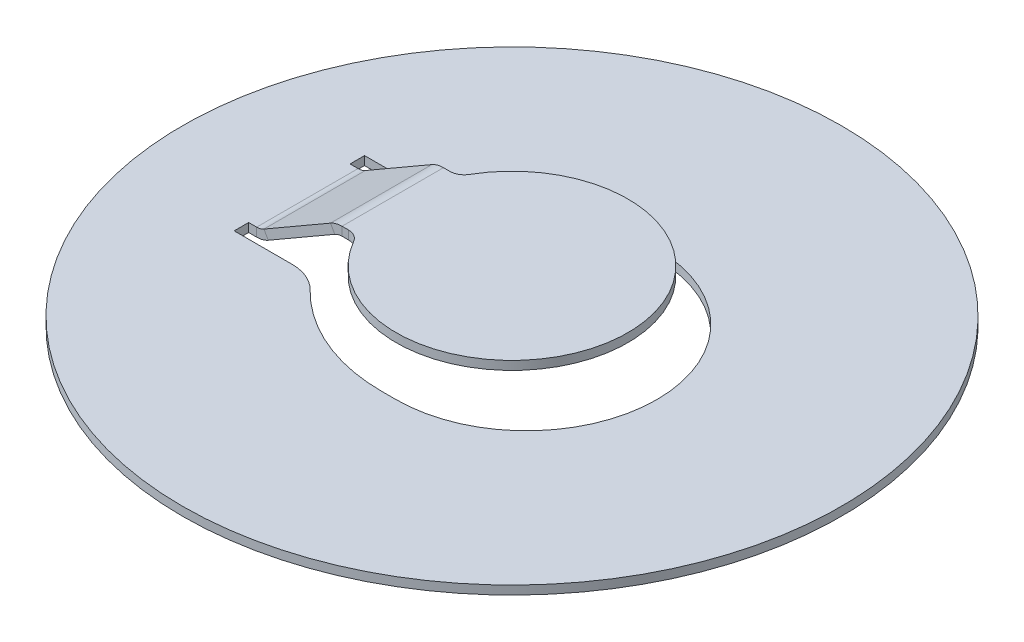
ISO-10303-21;
HEADER;
FILE_DESCRIPTION(('STEP AP214'),'2;1');
FILE_NAME('part.step','',(''),(''),'','','');
FILE_SCHEMA(('AUTOMOTIVE_DESIGN { 1 0 10303 214 1 1 1 1 }'));
ENDSEC;
DATA;
#1=APPLICATION_CONTEXT('core data for automotive mechanical design processes');
#2=APPLICATION_PROTOCOL_DEFINITION('international standard','automotive_design',2000,#1);
#3=PRODUCT_CONTEXT('',#1,'mechanical');
#4=PRODUCT('Part','Part','',(#3));
#5=PRODUCT_RELATED_PRODUCT_CATEGORY('part','',(#4));
#6=PRODUCT_DEFINITION_FORMATION('','',#4);
#7=PRODUCT_DEFINITION_CONTEXT('part definition',#1,'design');
#8=PRODUCT_DEFINITION('design','',#6,#7);
#9=PRODUCT_DEFINITION_SHAPE('','',#8);
#10=(LENGTH_UNIT() NAMED_UNIT(*) SI_UNIT(.MILLI.,.METRE.));
#11=(NAMED_UNIT(*) PLANE_ANGLE_UNIT() SI_UNIT($,.RADIAN.));
#12=(NAMED_UNIT(*) SI_UNIT($,.STERADIAN.) SOLID_ANGLE_UNIT());
#13=UNCERTAINTY_MEASURE_WITH_UNIT(LENGTH_MEASURE(1.E-05),#10,'distance_accuracy_value','');
#14=(GEOMETRIC_REPRESENTATION_CONTEXT(3) GLOBAL_UNCERTAINTY_ASSIGNED_CONTEXT((#13)) GLOBAL_UNIT_ASSIGNED_CONTEXT((#10,
#11,#12)) REPRESENTATION_CONTEXT('',''));
#15=CARTESIAN_POINT('',(0.,0.,0.));
#16=DIRECTION('',(0.,0.,1.));
#17=DIRECTION('',(1.,0.,0.));
#18=AXIS2_PLACEMENT_3D('',#15,#16,#17);
#19=CARTESIAN_POINT('',(-6.92846096908269,0.299999999999998,-1.75));
#20=DIRECTION('',(0.,0.,-1.));
#21=DIRECTION('',(-0.866025403784442,-0.499999999999995,0.));
#22=AXIS2_PLACEMENT_3D('',#19,#20,#21);
#23=PLANE('',#22);
#24=DIRECTION('',(-0.499999999999995,0.866025403784441,0.));
#25=VECTOR('',#24,1.);
#26=CARTESIAN_POINT('',(-4.51602540378444,1.69282032302755,-1.75));
#27=LINE('',#26,#25);
#28=CARTESIAN_POINT('',(-4.36602540378444,1.43301270189222,-1.75));
#29=VERTEX_POINT('',#28);
#30=CARTESIAN_POINT('',(-4.51602540378444,1.69282032302755,-1.75));
#31=VERTEX_POINT('',#30);
#32=EDGE_CURVE('E11',#29,#31,#27,.T.);
#33=ORIENTED_EDGE('',*,*,#32,.F.);
#34=DIRECTION('',(-0.866025403784442,-0.499999999999995,0.));
#35=VECTOR('',#34,1.);
#36=CARTESIAN_POINT('',(-6.77846096908269,0.0401923788646675,-1.75));
#37=LINE('',#36,#35);
#38=CARTESIAN_POINT('',(-6.66243556529825,0.107179676972447,-1.75));
#39=VERTEX_POINT('',#38);
#40=EDGE_CURVE('E137',#29,#39,#37,.T.);
#41=ORIENTED_EDGE('',*,*,#40,.T.);
#42=DIRECTION('',(-0.499999999999995,0.866025403784441,0.));
#43=VECTOR('',#42,1.);
#44=CARTESIAN_POINT('',(-6.81243556529825,0.366987298107779,-1.75));
#45=LINE('',#44,#43);
#46=CARTESIAN_POINT('',(-6.81243556529825,0.366987298107779,-1.75));
#47=VERTEX_POINT('',#46);
#48=EDGE_CURVE('E49',#39,#47,#45,.T.);
#49=ORIENTED_EDGE('',*,*,#48,.T.);
#50=DIRECTION('',(-0.866025403784442,-0.499999999999995,0.));
#51=VECTOR('',#50,1.);
#52=CARTESIAN_POINT('',(-6.92846096908269,0.299999999999998,-1.75));
#53=LINE('',#52,#51);
#54=EDGE_CURVE('E140',#31,#47,#53,.T.);
#55=ORIENTED_EDGE('',*,*,#54,.F.);
#56=EDGE_LOOP('',(#33,#41,#49,#55));
#57=FACE_BOUND('',#56,.T.);
#58=ADVANCED_FACE('F39',(#57),#23,.T.);
#59=CARTESIAN_POINT('',(-7.06243556529825,0.8,-1.75));
#60=DIRECTION('',(0.,0.,-1.));
#61=DIRECTION('',(-1.,0.,0.));
#62=AXIS2_PLACEMENT_3D('',#59,#60,#61);
#63=PLANE('',#62);
#64=ORIENTED_EDGE('',*,*,#48,.F.);
#65=CARTESIAN_POINT('',(-7.06243556529825,0.8,-1.75));
#66=DIRECTION('',(0.,0.,-1.));
#67=DIRECTION('',(-1.,0.,0.));
#68=AXIS2_PLACEMENT_3D('',#65,#66,#67);
#69=CIRCLE('',#68,0.8);
#70=CARTESIAN_POINT('',(-7.06243556529825,0.,-1.75));
#71=VERTEX_POINT('',#70);
#72=EDGE_CURVE('E176',#39,#71,#69,.T.);
#73=ORIENTED_EDGE('',*,*,#72,.T.);
#74=DIRECTION('',(0.,1.,0.));
#75=VECTOR('',#74,1.);
#76=CARTESIAN_POINT('',(-7.06243556529825,0.3,-1.75));
#77=LINE('',#76,#75);
#78=CARTESIAN_POINT('',(-7.06243556529825,0.3,-1.75));
#79=VERTEX_POINT('',#78);
#80=EDGE_CURVE('E57',#71,#79,#77,.T.);
#81=ORIENTED_EDGE('',*,*,#80,.T.);
#82=CARTESIAN_POINT('',(-7.06243556529825,0.8,-1.75));
#83=DIRECTION('',(0.,0.,1.));
#84=DIRECTION('',(1.,0.,0.));
#85=AXIS2_PLACEMENT_3D('',#82,#83,#84);
#86=CIRCLE('',#85,0.5);
#87=EDGE_CURVE('E257',#47,#79,#86,.F.);
#88=ORIENTED_EDGE('',*,*,#87,.F.);
#89=EDGE_LOOP('',(#64,#73,#81,#88));
#90=FACE_BOUND('',#89,.T.);
#91=ADVANCED_FACE('F258',(#90),#63,.T.);
#92=CARTESIAN_POINT('',(-6.92846096908269,0.3,-1.75));
#93=DIRECTION('',(0.,0.,-1.));
#94=DIRECTION('',(-1.,0.,0.));
#95=AXIS2_PLACEMENT_3D('',#92,#93,#94);
#96=PLANE('',#95);
#97=ORIENTED_EDGE('',*,*,#80,.F.);
#98=DIRECTION('',(-1.,0.,0.));
#99=VECTOR('',#98,1.);
#100=CARTESIAN_POINT('',(-6.92846096908269,0.,-1.75));
#101=LINE('',#100,#99);
#102=CARTESIAN_POINT('',(-7.33957850633199,0.,-1.75));
#103=VERTEX_POINT('',#102);
#104=EDGE_CURVE('E304',#71,#103,#101,.T.);
#105=ORIENTED_EDGE('',*,*,#104,.T.);
#106=DIRECTION('',(0.,1.,0.));
#107=VECTOR('',#106,1.);
#108=CARTESIAN_POINT('',(-7.33957850633199,0.3,-1.75));
#109=LINE('',#108,#107);
#110=CARTESIAN_POINT('',(-7.33957850633199,0.3,-1.75));
#111=VERTEX_POINT('',#110);
#112=EDGE_CURVE('E241',#103,#111,#109,.T.);
#113=ORIENTED_EDGE('',*,*,#112,.T.);
#114=DIRECTION('',(-1.,0.,0.));
#115=VECTOR('',#114,1.);
#116=CARTESIAN_POINT('',(-6.92846096908269,0.3,-1.75));
#117=LINE('',#116,#115);
#118=EDGE_CURVE('E352',#79,#111,#117,.T.);
#119=ORIENTED_EDGE('',*,*,#118,.F.);
#120=EDGE_LOOP('',(#97,#105,#113,#119));
#121=FACE_BOUND('',#120,.T.);
#122=ADVANCED_FACE('F349',(#121),#96,.T.);
#123=CARTESIAN_POINT('',(-7.33957850633199,0.3,-1.75));
#124=DIRECTION('',(1.,0.,0.));
#125=DIRECTION('',(0.,0.,-1.));
#126=AXIS2_PLACEMENT_3D('',#123,#124,#125);
#127=PLANE('',#126);
#128=ORIENTED_EDGE('',*,*,#112,.F.);
#129=DIRECTION('',(0.,0.,1.));
#130=VECTOR('',#129,1.);
#131=CARTESIAN_POINT('',(-7.33957850633199,0.,-15.));
#132=LINE('',#131,#130);
#133=CARTESIAN_POINT('',(-7.33957850633199,0.,-2.25));
#134=VERTEX_POINT('',#133);
#135=EDGE_CURVE('E333',#103,#134,#132,.F.);
#136=ORIENTED_EDGE('',*,*,#135,.T.);
#137=DIRECTION('',(0.,1.,0.));
#138=VECTOR('',#137,1.);
#139=CARTESIAN_POINT('',(-7.33957850633199,0.3,-2.25));
#140=LINE('',#139,#138);
#141=CARTESIAN_POINT('',(-7.33957850633199,0.3,-2.25));
#142=VERTEX_POINT('',#141);
#143=EDGE_CURVE('E238',#134,#142,#140,.T.);
#144=ORIENTED_EDGE('',*,*,#143,.T.);
#145=DIRECTION('',(0.,0.,-1.));
#146=VECTOR('',#145,1.);
#147=CARTESIAN_POINT('',(-7.33957850633199,0.3,-1.75));
#148=LINE('',#147,#146);
#149=EDGE_CURVE('E356',#111,#142,#148,.T.);
#150=ORIENTED_EDGE('',*,*,#149,.F.);
#151=EDGE_LOOP('',(#128,#136,#144,#150));
#152=FACE_BOUND('',#151,.T.);
#153=ADVANCED_FACE('F516',(#152),#127,.T.);
#154=CARTESIAN_POINT('',(-7.33957850633199,0.3,-2.25));
#155=DIRECTION('',(0.,0.,1.));
#156=DIRECTION('',(1.,0.,0.));
#157=AXIS2_PLACEMENT_3D('',#154,#155,#156);
#158=PLANE('',#157);
#159=ORIENTED_EDGE('',*,*,#143,.F.);
#160=DIRECTION('',(-1.,0.,0.));
#161=VECTOR('',#160,1.);
#162=CARTESIAN_POINT('',(-6.92846096908269,0.,-2.25));
#163=LINE('',#162,#161);
#164=CARTESIAN_POINT('',(-5.33957850633199,0.,-2.25));
#165=VERTEX_POINT('',#164);
#166=EDGE_CURVE('E330',#134,#165,#163,.F.);
#167=ORIENTED_EDGE('',*,*,#166,.T.);
#168=DIRECTION('',(0.,1.,0.));
#169=VECTOR('',#168,1.);
#170=CARTESIAN_POINT('',(-5.33957850633199,0.3,-2.25));
#171=LINE('',#170,#169);
#172=CARTESIAN_POINT('',(-5.33957850633199,0.3,-2.25));
#173=VERTEX_POINT('',#172);
#174=EDGE_CURVE('E235',#165,#173,#171,.T.);
#175=ORIENTED_EDGE('',*,*,#174,.T.);
#176=DIRECTION('',(1.,0.,0.));
#177=VECTOR('',#176,1.);
#178=CARTESIAN_POINT('',(-7.33957850633199,0.3,-2.25));
#179=LINE('',#178,#177);
#180=EDGE_CURVE('E379',#142,#173,#179,.T.);
#181=ORIENTED_EDGE('',*,*,#180,.F.);
#182=EDGE_LOOP('',(#159,#167,#175,#181));
#183=FACE_BOUND('',#182,.T.);
#184=ADVANCED_FACE('F514',(#183),#158,.T.);
#185=CARTESIAN_POINT('',(-5.33957850633199,0.3,-3.75));
#186=DIRECTION('',(0.,1.,0.));
#187=DIRECTION('',(-1.,0.,0.));
#188=AXIS2_PLACEMENT_3D('',#185,#186,#187);
#189=CYLINDRICAL_SURFACE('',#188,1.5);
#190=ORIENTED_EDGE('',*,*,#174,.F.);
#191=CARTESIAN_POINT('',(-5.33957850633199,0.,-3.75));
#192=DIRECTION('',(0.,1.,0.));
#193=DIRECTION('',(0.,0.,1.));
#194=AXIS2_PLACEMENT_3D('',#191,#192,#193);
#195=CIRCLE('',#194,1.5);
#196=CARTESIAN_POINT('',(-4.26605179506073,0.,-2.70236437623231));
#197=VERTEX_POINT('',#196);
#198=EDGE_CURVE('E327',#165,#197,#195,.T.);
#199=ORIENTED_EDGE('',*,*,#198,.T.);
#200=DIRECTION('',(0.,1.,0.));
#201=VECTOR('',#200,1.);
#202=CARTESIAN_POINT('',(-4.26605179506073,0.3,-2.70236437623231));
#203=LINE('',#202,#201);
#204=CARTESIAN_POINT('',(-4.26605179506073,0.3,-2.70236437623231));
#205=VERTEX_POINT('',#204);
#206=EDGE_CURVE('E232',#197,#205,#203,.T.);
#207=ORIENTED_EDGE('',*,*,#206,.T.);
#208=CARTESIAN_POINT('',(-5.33957850633199,0.3,-3.75));
#209=DIRECTION('',(0.,1.,0.));
#210=DIRECTION('',(0.,0.,1.));
#211=AXIS2_PLACEMENT_3D('',#208,#209,#210);
#212=CIRCLE('',#211,1.5);
#213=EDGE_CURVE('E382',#173,#205,#212,.T.);
#214=ORIENTED_EDGE('',*,*,#213,.F.);
#215=EDGE_LOOP('',(#190,#199,#207,#214));
#216=FACE_BOUND('',#215,.T.);
#217=ADVANCED_FACE('F511',(#216),#189,.T.);
#218=CARTESIAN_POINT('',(0.,0.3,1.46079969450723));
#219=DIRECTION('',(0.,1.,0.));
#220=DIRECTION('',(-1.,0.,0.));
#221=AXIS2_PLACEMENT_3D('',#218,#219,#220);
#222=CYLINDRICAL_SURFACE('',#221,5.96079969450723);
#223=ORIENTED_EDGE('',*,*,#206,.F.);
#224=CARTESIAN_POINT('',(0.,0.,1.46079969450723));
#225=DIRECTION('',(0.,-1.,0.));
#226=DIRECTION('',(0.,0.,-1.));
#227=AXIS2_PLACEMENT_3D('',#224,#225,#226);
#228=CIRCLE('',#227,5.96079969450723);
#229=CARTESIAN_POINT('',(0.,0.,-4.5));
#230=VERTEX_POINT('',#229);
#231=EDGE_CURVE('E324',#197,#230,#228,.T.);
#232=ORIENTED_EDGE('',*,*,#231,.T.);
#233=DIRECTION('',(0.,1.,0.));
#234=VECTOR('',#233,1.);
#235=CARTESIAN_POINT('',(0.,0.3,-4.5));
#236=LINE('',#235,#234);
#237=CARTESIAN_POINT('',(0.,0.3,-4.5));
#238=VERTEX_POINT('',#237);
#239=EDGE_CURVE('E229',#230,#238,#236,.T.);
#240=ORIENTED_EDGE('',*,*,#239,.T.);
#241=CARTESIAN_POINT('',(0.,0.3,1.46079969450723));
#242=DIRECTION('',(0.,-1.,0.));
#243=DIRECTION('',(0.,0.,-1.));
#244=AXIS2_PLACEMENT_3D('',#241,#242,#243);
#245=CIRCLE('',#244,5.96079969450723);
#246=EDGE_CURVE('E385',#205,#238,#245,.T.);
#247=ORIENTED_EDGE('',*,*,#246,.F.);
#248=EDGE_LOOP('',(#223,#232,#240,#247));
#249=FACE_BOUND('',#248,.T.);
#250=ADVANCED_FACE('F508',(#249),#222,.F.);
#251=CARTESIAN_POINT('',(0.,0.3,-4.5));
#252=DIRECTION('',(0.,0.,1.));
#253=DIRECTION('',(1.,0.,0.));
#254=AXIS2_PLACEMENT_3D('',#251,#252,#253);
#255=PLANE('',#254);
#256=ORIENTED_EDGE('',*,*,#239,.F.);
#257=DIRECTION('',(-1.,0.,0.));
#258=VECTOR('',#257,1.);
#259=CARTESIAN_POINT('',(-6.92846096908269,0.,-4.5));
#260=LINE('',#259,#258);
#261=CARTESIAN_POINT('',(0.499999999999998,0.,-4.5));
#262=VERTEX_POINT('',#261);
#263=EDGE_CURVE('E321',#230,#262,#260,.F.);
#264=ORIENTED_EDGE('',*,*,#263,.T.);
#265=DIRECTION('',(0.,1.,0.));
#266=VECTOR('',#265,1.);
#267=CARTESIAN_POINT('',(0.499999999999998,0.3,-4.5));
#268=LINE('',#267,#266);
#269=CARTESIAN_POINT('',(0.499999999999998,0.3,-4.5));
#270=VERTEX_POINT('',#269);
#271=EDGE_CURVE('E226',#262,#270,#268,.T.);
#272=ORIENTED_EDGE('',*,*,#271,.T.);
#273=DIRECTION('',(1.,0.,0.));
#274=VECTOR('',#273,1.);
#275=CARTESIAN_POINT('',(0.,0.3,-4.5));
#276=LINE('',#275,#274);
#277=EDGE_CURVE('E388',#238,#270,#276,.T.);
#278=ORIENTED_EDGE('',*,*,#277,.F.);
#279=EDGE_LOOP('',(#256,#264,#272,#278));
#280=FACE_BOUND('',#279,.T.);
#281=ADVANCED_FACE('F503',(#280),#255,.T.);
#282=CARTESIAN_POINT('',(0.499999999999998,0.3,0.));
#283=DIRECTION('',(0.,1.,0.));
#284=DIRECTION('',(-1.,0.,0.));
#285=AXIS2_PLACEMENT_3D('',#282,#283,#284);
#286=CYLINDRICAL_SURFACE('',#285,4.5);
#287=ORIENTED_EDGE('',*,*,#271,.F.);
#288=CARTESIAN_POINT('',(0.499999999999998,0.,0.));
#289=DIRECTION('',(0.,-1.,0.));
#290=DIRECTION('',(0.,0.,-1.));
#291=AXIS2_PLACEMENT_3D('',#288,#289,#290);
#292=CIRCLE('',#291,4.5);
#293=CARTESIAN_POINT('',(0.499999999999998,0.,4.5));
#294=VERTEX_POINT('',#293);
#295=EDGE_CURVE('E318',#262,#294,#292,.T.);
#296=ORIENTED_EDGE('',*,*,#295,.T.);
#297=DIRECTION('',(0.,1.,0.));
#298=VECTOR('',#297,1.);
#299=CARTESIAN_POINT('',(0.499999999999998,0.3,4.5));
#300=LINE('',#299,#298);
#301=CARTESIAN_POINT('',(0.499999999999998,0.3,4.5));
#302=VERTEX_POINT('',#301);
#303=EDGE_CURVE('E223',#294,#302,#300,.T.);
#304=ORIENTED_EDGE('',*,*,#303,.T.);
#305=CARTESIAN_POINT('',(0.499999999999998,0.3,0.));
#306=DIRECTION('',(0.,-1.,0.));
#307=DIRECTION('',(0.,0.,1.));
#308=AXIS2_PLACEMENT_3D('',#305,#306,#307);
#309=CIRCLE('',#308,4.5);
#310=EDGE_CURVE('E391',#270,#302,#309,.T.);
#311=ORIENTED_EDGE('',*,*,#310,.F.);
#312=EDGE_LOOP('',(#287,#296,#304,#311));
#313=FACE_BOUND('',#312,.T.);
#314=ADVANCED_FACE('F499',(#313),#286,.F.);
#315=CARTESIAN_POINT('',(0.,0.3,4.5));
#316=DIRECTION('',(0.,0.,-1.));
#317=DIRECTION('',(-1.,0.,0.));
#318=AXIS2_PLACEMENT_3D('',#315,#316,#317);
#319=PLANE('',#318);
#320=ORIENTED_EDGE('',*,*,#303,.F.);
#321=DIRECTION('',(-1.,0.,0.));
#322=VECTOR('',#321,1.);
#323=CARTESIAN_POINT('',(-6.92846096908269,0.,4.5));
#324=LINE('',#323,#322);
#325=CARTESIAN_POINT('',(0.,0.,4.5));
#326=VERTEX_POINT('',#325);
#327=EDGE_CURVE('E315',#294,#326,#324,.T.);
#328=ORIENTED_EDGE('',*,*,#327,.T.);
#329=DIRECTION('',(0.,1.,0.));
#330=VECTOR('',#329,1.);
#331=CARTESIAN_POINT('',(0.,0.3,4.5));
#332=LINE('',#331,#330);
#333=CARTESIAN_POINT('',(0.,0.3,4.5));
#334=VERTEX_POINT('',#333);
#335=EDGE_CURVE('E220',#326,#334,#332,.T.);
#336=ORIENTED_EDGE('',*,*,#335,.T.);
#337=DIRECTION('',(-1.,0.,0.));
#338=VECTOR('',#337,1.);
#339=CARTESIAN_POINT('',(0.,0.3,4.5));
#340=LINE('',#339,#338);
#341=EDGE_CURVE('E394',#302,#334,#340,.T.);
#342=ORIENTED_EDGE('',*,*,#341,.F.);
#343=EDGE_LOOP('',(#320,#328,#336,#342));
#344=FACE_BOUND('',#343,.T.);
#345=ADVANCED_FACE('F496',(#344),#319,.T.);
#346=CARTESIAN_POINT('',(0.,0.3,-1.46079969450723));
#347=DIRECTION('',(0.,1.,0.));
#348=DIRECTION('',(-1.,0.,0.));
#349=AXIS2_PLACEMENT_3D('',#346,#347,#348);
#350=CYLINDRICAL_SURFACE('',#349,5.96079969450723);
#351=ORIENTED_EDGE('',*,*,#335,.F.);
#352=CARTESIAN_POINT('',(0.,0.,-1.46079969450723));
#353=DIRECTION('',(0.,-1.,0.));
#354=DIRECTION('',(0.,0.,-1.));
#355=AXIS2_PLACEMENT_3D('',#352,#353,#354);
#356=CIRCLE('',#355,5.96079969450723);
#357=CARTESIAN_POINT('',(-4.26605179506073,0.,2.70236437623231));
#358=VERTEX_POINT('',#357);
#359=EDGE_CURVE('E312',#326,#358,#356,.T.);
#360=ORIENTED_EDGE('',*,*,#359,.T.);
#361=DIRECTION('',(0.,1.,0.));
#362=VECTOR('',#361,1.);
#363=CARTESIAN_POINT('',(-4.26605179506073,0.3,2.70236437623231));
#364=LINE('',#363,#362);
#365=CARTESIAN_POINT('',(-4.26605179506073,0.3,2.70236437623231));
#366=VERTEX_POINT('',#365);
#367=EDGE_CURVE('E217',#358,#366,#364,.T.);
#368=ORIENTED_EDGE('',*,*,#367,.T.);
#369=CARTESIAN_POINT('',(0.,0.3,-1.46079969450723));
#370=DIRECTION('',(0.,-1.,0.));
#371=DIRECTION('',(0.,0.,1.));
#372=AXIS2_PLACEMENT_3D('',#369,#370,#371);
#373=CIRCLE('',#372,5.96079969450723);
#374=EDGE_CURVE('E397',#334,#366,#373,.T.);
#375=ORIENTED_EDGE('',*,*,#374,.F.);
#376=EDGE_LOOP('',(#351,#360,#368,#375));
#377=FACE_BOUND('',#376,.T.);
#378=ADVANCED_FACE('F491',(#377),#350,.F.);
#379=CARTESIAN_POINT('',(-5.33957850633199,0.3,3.75));
#380=DIRECTION('',(0.,1.,0.));
#381=DIRECTION('',(-1.,0.,0.));
#382=AXIS2_PLACEMENT_3D('',#379,#380,#381);
#383=CYLINDRICAL_SURFACE('',#382,1.5);
#384=ORIENTED_EDGE('',*,*,#367,.F.);
#385=CARTESIAN_POINT('',(-5.33957850633199,0.,3.75));
#386=DIRECTION('',(0.,1.,0.));
#387=DIRECTION('',(0.,0.,1.));
#388=AXIS2_PLACEMENT_3D('',#385,#386,#387);
#389=CIRCLE('',#388,1.5);
#390=CARTESIAN_POINT('',(-5.33957850633199,0.,2.25));
#391=VERTEX_POINT('',#390);
#392=EDGE_CURVE('E309',#358,#391,#389,.T.);
#393=ORIENTED_EDGE('',*,*,#392,.T.);
#394=DIRECTION('',(0.,1.,0.));
#395=VECTOR('',#394,1.);
#396=CARTESIAN_POINT('',(-5.33957850633199,0.3,2.25));
#397=LINE('',#396,#395);
#398=CARTESIAN_POINT('',(-5.33957850633199,0.3,2.25));
#399=VERTEX_POINT('',#398);
#400=EDGE_CURVE('E214',#391,#399,#397,.T.);
#401=ORIENTED_EDGE('',*,*,#400,.T.);
#402=CARTESIAN_POINT('',(-5.33957850633199,0.3,3.75));
#403=DIRECTION('',(0.,1.,0.));
#404=DIRECTION('',(0.,0.,-1.));
#405=AXIS2_PLACEMENT_3D('',#402,#403,#404);
#406=CIRCLE('',#405,1.5);
#407=EDGE_CURVE('E400',#366,#399,#406,.T.);
#408=ORIENTED_EDGE('',*,*,#407,.F.);
#409=EDGE_LOOP('',(#384,#393,#401,#408));
#410=FACE_BOUND('',#409,.T.);
#411=ADVANCED_FACE('F487',(#410),#383,.T.);
#412=CARTESIAN_POINT('',(-7.33957850633199,0.3,2.25));
#413=DIRECTION('',(0.,0.,-1.));
#414=DIRECTION('',(-1.,0.,0.));
#415=AXIS2_PLACEMENT_3D('',#412,#413,#414);
#416=PLANE('',#415);
#417=ORIENTED_EDGE('',*,*,#400,.F.);
#418=DIRECTION('',(-1.,0.,0.));
#419=VECTOR('',#418,1.);
#420=CARTESIAN_POINT('',(-6.92846096908269,0.,2.25));
#421=LINE('',#420,#419);
#422=CARTESIAN_POINT('',(-7.33957850633199,0.,2.25));
#423=VERTEX_POINT('',#422);
#424=EDGE_CURVE('E184',#391,#423,#421,.T.);
#425=ORIENTED_EDGE('',*,*,#424,.T.);
#426=DIRECTION('',(0.,1.,0.));
#427=VECTOR('',#426,1.);
#428=CARTESIAN_POINT('',(-7.33957850633199,0.3,2.25));
#429=LINE('',#428,#427);
#430=CARTESIAN_POINT('',(-7.33957850633199,0.3,2.25));
#431=VERTEX_POINT('',#430);
#432=EDGE_CURVE('E211',#423,#431,#429,.T.);
#433=ORIENTED_EDGE('',*,*,#432,.T.);
#434=DIRECTION('',(-1.,0.,0.));
#435=VECTOR('',#434,1.);
#436=CARTESIAN_POINT('',(-7.33957850633199,0.3,2.25));
#437=LINE('',#436,#435);
#438=EDGE_CURVE('E403',#399,#431,#437,.T.);
#439=ORIENTED_EDGE('',*,*,#438,.F.);
#440=EDGE_LOOP('',(#417,#425,#433,#439));
#441=FACE_BOUND('',#440,.T.);
#442=ADVANCED_FACE('F483',(#441),#416,.T.);
#443=CARTESIAN_POINT('',(-7.33957850633199,0.3,1.75));
#444=DIRECTION('',(1.,0.,0.));
#445=DIRECTION('',(0.,0.,-1.));
#446=AXIS2_PLACEMENT_3D('',#443,#444,#445);
#447=PLANE('',#446);
#448=ORIENTED_EDGE('',*,*,#432,.F.);
#449=DIRECTION('',(0.,0.,1.));
#450=VECTOR('',#449,1.);
#451=CARTESIAN_POINT('',(-7.33957850633199,0.,-15.));
#452=LINE('',#451,#450);
#453=CARTESIAN_POINT('',(-7.33957850633199,0.,1.75));
#454=VERTEX_POINT('',#453);
#455=EDGE_CURVE('E167',#423,#454,#452,.F.);
#456=ORIENTED_EDGE('',*,*,#455,.T.);
#457=DIRECTION('',(0.,1.,0.));
#458=VECTOR('',#457,1.);
#459=CARTESIAN_POINT('',(-7.33957850633199,0.3,1.75));
#460=LINE('',#459,#458);
#461=CARTESIAN_POINT('',(-7.33957850633199,0.3,1.75));
#462=VERTEX_POINT('',#461);
#463=EDGE_CURVE('E208',#454,#462,#460,.T.);
#464=ORIENTED_EDGE('',*,*,#463,.T.);
#465=DIRECTION('',(0.,0.,-1.));
#466=VECTOR('',#465,1.);
#467=CARTESIAN_POINT('',(-7.33957850633199,0.3,1.75));
#468=LINE('',#467,#466);
#469=EDGE_CURVE('E254',#431,#462,#468,.T.);
#470=ORIENTED_EDGE('',*,*,#469,.F.);
#471=EDGE_LOOP('',(#448,#456,#464,#470));
#472=FACE_BOUND('',#471,.T.);
#473=ADVANCED_FACE('F477',(#472),#447,.T.);
#474=CARTESIAN_POINT('',(-6.92846096908268,0.3,1.75));
#475=DIRECTION('',(0.,0.,1.));
#476=DIRECTION('',(1.,0.,0.));
#477=AXIS2_PLACEMENT_3D('',#474,#475,#476);
#478=PLANE('',#477);
#479=ORIENTED_EDGE('',*,*,#463,.F.);
#480=DIRECTION('',(-1.,0.,0.));
#481=VECTOR('',#480,1.);
#482=CARTESIAN_POINT('',(-6.92846096908269,0.,1.75));
#483=LINE('',#482,#481);
#484=CARTESIAN_POINT('',(-7.06243556529825,0.,1.75));
#485=VERTEX_POINT('',#484);
#486=EDGE_CURVE('E301',#454,#485,#483,.F.);
#487=ORIENTED_EDGE('',*,*,#486,.T.);
#488=DIRECTION('',(0.,1.,0.));
#489=VECTOR('',#488,1.);
#490=CARTESIAN_POINT('',(-7.06243556529825,0.3,1.75));
#491=LINE('',#490,#489);
#492=CARTESIAN_POINT('',(-7.06243556529825,0.3,1.75));
#493=VERTEX_POINT('',#492);
#494=EDGE_CURVE('E206',#485,#493,#491,.T.);
#495=ORIENTED_EDGE('',*,*,#494,.T.);
#496=DIRECTION('',(1.,0.,0.));
#497=VECTOR('',#496,1.);
#498=CARTESIAN_POINT('',(-6.92846096908268,0.3,1.75));
#499=LINE('',#498,#497);
#500=EDGE_CURVE('E357',#462,#493,#499,.T.);
#501=ORIENTED_EDGE('',*,*,#500,.F.);
#502=EDGE_LOOP('',(#479,#487,#495,#501));
#503=FACE_BOUND('',#502,.T.);
#504=ADVANCED_FACE('F479',(#503),#478,.T.);
#505=CARTESIAN_POINT('',(-7.06243556529825,0.8,1.75));
#506=DIRECTION('',(0.,0.,1.));
#507=DIRECTION('',(1.,0.,0.));
#508=AXIS2_PLACEMENT_3D('',#505,#506,#507);
#509=PLANE('',#508);
#510=ORIENTED_EDGE('',*,*,#494,.F.);
#511=CARTESIAN_POINT('',(-7.06243556529825,0.8,1.75));
#512=DIRECTION('',(0.,0.,-1.));
#513=DIRECTION('',(-1.,0.,0.));
#514=AXIS2_PLACEMENT_3D('',#511,#512,#513);
#515=CIRCLE('',#514,0.8);
#516=CARTESIAN_POINT('',(-6.66243556529825,0.107179676972447,1.75));
#517=VERTEX_POINT('',#516);
#518=EDGE_CURVE('E298',#485,#517,#515,.F.);
#519=ORIENTED_EDGE('',*,*,#518,.T.);
#520=DIRECTION('',(-0.499999999999995,0.866025403784441,0.));
#521=VECTOR('',#520,1.);
#522=CARTESIAN_POINT('',(-6.81243556529825,0.366987298107779,1.75));
#523=LINE('',#522,#521);
#524=CARTESIAN_POINT('',(-6.81243556529825,0.366987298107779,1.75));
#525=VERTEX_POINT('',#524);
#526=EDGE_CURVE('E203',#517,#525,#523,.T.);
#527=ORIENTED_EDGE('',*,*,#526,.T.);
#528=CARTESIAN_POINT('',(-7.06243556529825,0.8,1.75));
#529=DIRECTION('',(0.,0.,-1.));
#530=DIRECTION('',(-1.,0.,0.));
#531=AXIS2_PLACEMENT_3D('',#528,#529,#530);
#532=CIRCLE('',#531,0.5);
#533=EDGE_CURVE('E263',#493,#525,#532,.F.);
#534=ORIENTED_EDGE('',*,*,#533,.F.);
#535=EDGE_LOOP('',(#510,#519,#527,#534));
#536=FACE_BOUND('',#535,.T.);
#537=ADVANCED_FACE('F369',(#536),#509,.T.);
#538=CARTESIAN_POINT('',(-6.92846096908268,0.300000000000001,1.75));
#539=DIRECTION('',(0.,0.,1.));
#540=DIRECTION('',(0.866025403784442,0.499999999999995,0.));
#541=AXIS2_PLACEMENT_3D('',#538,#539,#540);
#542=PLANE('',#541);
#543=ORIENTED_EDGE('',*,*,#526,.F.);
#544=DIRECTION('',(-0.866025403784442,-0.499999999999995,0.));
#545=VECTOR('',#544,1.);
#546=CARTESIAN_POINT('',(-6.77846096908269,0.0401923788646675,1.75));
#547=LINE('',#546,#545);
#548=CARTESIAN_POINT('',(-4.36602540378444,1.43301270189222,1.75));
#549=VERTEX_POINT('',#548);
#550=EDGE_CURVE('E168',#517,#549,#547,.F.);
#551=ORIENTED_EDGE('',*,*,#550,.T.);
#552=DIRECTION('',(-0.499999999999994,0.866025403784442,0.));
#553=VECTOR('',#552,1.);
#554=CARTESIAN_POINT('',(-4.51602540378444,1.69282032302755,1.75));
#555=LINE('',#554,#553);
#556=CARTESIAN_POINT('',(-4.51602540378444,1.69282032302755,1.75));
#557=VERTEX_POINT('',#556);
#558=EDGE_CURVE('E200',#549,#557,#555,.T.);
#559=ORIENTED_EDGE('',*,*,#558,.T.);
#560=DIRECTION('',(0.866025403784442,0.499999999999995,0.));
#561=VECTOR('',#560,1.);
#562=CARTESIAN_POINT('',(-6.92846096908268,0.300000000000001,1.75));
#563=LINE('',#562,#561);
#564=EDGE_CURVE('E255',#525,#557,#563,.T.);
#565=ORIENTED_EDGE('',*,*,#564,.F.);
#566=EDGE_LOOP('',(#543,#551,#559,#565));
#567=FACE_BOUND('',#566,.T.);
#568=ADVANCED_FACE('F372',(#567),#542,.T.);
#569=CARTESIAN_POINT('',(-4.11602540378444,1.,1.75));
#570=DIRECTION('',(0.,0.,-1.));
#571=DIRECTION('',(-1.,0.,0.));
#572=AXIS2_PLACEMENT_3D('',#569,#570,#571);
#573=PLANE('',#572);
#574=ORIENTED_EDGE('',*,*,#558,.F.);
#575=CARTESIAN_POINT('',(-4.11602540378444,1.,1.75));
#576=DIRECTION('',(0.,0.,1.));
#577=DIRECTION('',(1.,0.,0.));
#578=AXIS2_PLACEMENT_3D('',#575,#576,#577);
#579=CIRCLE('',#578,0.5);
#580=CARTESIAN_POINT('',(-4.11602540378444,1.5,1.75));
#581=VERTEX_POINT('',#580);
#582=EDGE_CURVE('E156',#549,#581,#579,.F.);
#583=ORIENTED_EDGE('',*,*,#582,.T.);
#584=DIRECTION('',(0.,1.,0.));
#585=VECTOR('',#584,1.);
#586=CARTESIAN_POINT('',(-4.11602540378444,1.8,1.75));
#587=LINE('',#586,#585);
#588=CARTESIAN_POINT('',(-4.11602540378444,1.8,1.75));
#589=VERTEX_POINT('',#588);
#590=EDGE_CURVE('E197',#581,#589,#587,.T.);
#591=ORIENTED_EDGE('',*,*,#590,.T.);
#592=CARTESIAN_POINT('',(-4.11602540378444,1.,1.75));
#593=DIRECTION('',(0.,0.,1.));
#594=DIRECTION('',(1.,0.,0.));
#595=AXIS2_PLACEMENT_3D('',#592,#593,#594);
#596=CIRCLE('',#595,0.8);
#597=EDGE_CURVE('E262',#557,#589,#596,.F.);
#598=ORIENTED_EDGE('',*,*,#597,.F.);
#599=EDGE_LOOP('',(#574,#583,#591,#598));
#600=FACE_BOUND('',#599,.T.);
#601=ADVANCED_FACE('F574',(#600),#573,.F.);
#602=CARTESIAN_POINT('',(-16.0215001797184,1.8,1.75));
#603=DIRECTION('',(0.,0.,1.));
#604=DIRECTION('',(1.,0.,0.));
#605=AXIS2_PLACEMENT_3D('',#602,#603,#604);
#606=PLANE('',#605);
#607=ORIENTED_EDGE('',*,*,#590,.F.);
#608=DIRECTION('',(-1.,0.,0.));
#609=VECTOR('',#608,1.);
#610=CARTESIAN_POINT('',(4.25,1.5,1.75));
#611=LINE('',#610,#609);
#612=CARTESIAN_POINT('',(-3.89711431702998,1.5,1.75));
#613=VERTEX_POINT('',#612);
#614=EDGE_CURVE('E183',#581,#613,#611,.F.);
#615=ORIENTED_EDGE('',*,*,#614,.T.);
#616=DIRECTION('',(0.,1.,0.));
#617=VECTOR('',#616,1.);
#618=CARTESIAN_POINT('',(-3.89711431702997,1.8,1.75));
#619=LINE('',#618,#617);
#620=CARTESIAN_POINT('',(-3.89711431702997,1.8,1.75));
#621=VERTEX_POINT('',#620);
#622=EDGE_CURVE('E194',#613,#621,#619,.T.);
#623=ORIENTED_EDGE('',*,*,#622,.T.);
#624=DIRECTION('',(1.,0.,0.));
#625=VECTOR('',#624,1.);
#626=CARTESIAN_POINT('',(-16.0215001797184,1.8,1.75));
#627=LINE('',#626,#625);
#628=EDGE_CURVE('E408',#589,#621,#627,.T.);
#629=ORIENTED_EDGE('',*,*,#628,.F.);
#630=EDGE_LOOP('',(#607,#615,#623,#629));
#631=FACE_BOUND('',#630,.T.);
#632=ADVANCED_FACE('F435',(#631),#606,.T.);
#633=CARTESIAN_POINT('',(-3.89711431702997,1.8,2.25));
#634=DIRECTION('',(0.,1.,0.));
#635=DIRECTION('',(-1.,0.,0.));
#636=AXIS2_PLACEMENT_3D('',#633,#634,#635);
#637=CYLINDRICAL_SURFACE('',#636,0.5);
#638=ORIENTED_EDGE('',*,*,#622,.F.);
#639=CARTESIAN_POINT('',(-3.89711431702997,1.5,2.25));
#640=DIRECTION('',(0.,-1.,0.));
#641=DIRECTION('',(0.,0.,-1.));
#642=AXIS2_PLACEMENT_3D('',#639,#640,#641);
#643=CIRCLE('',#642,0.5);
#644=CARTESIAN_POINT('',(-3.46410161513776,1.5,2.));
#645=VERTEX_POINT('',#644);
#646=EDGE_CURVE('E293',#613,#645,#643,.T.);
#647=ORIENTED_EDGE('',*,*,#646,.T.);
#648=DIRECTION('',(0.,1.,0.));
#649=VECTOR('',#648,1.);
#650=CARTESIAN_POINT('',(-3.46410161513776,1.8,2.));
#651=LINE('',#650,#649);
#652=CARTESIAN_POINT('',(-3.46410161513776,1.8,2.));
#653=VERTEX_POINT('',#652);
#654=EDGE_CURVE('E191',#645,#653,#651,.T.);
#655=ORIENTED_EDGE('',*,*,#654,.T.);
#656=CARTESIAN_POINT('',(-3.89711431702997,1.8,2.25));
#657=DIRECTION('',(0.,-1.,0.));
#658=DIRECTION('',(0.,0.,-1.));
#659=AXIS2_PLACEMENT_3D('',#656,#657,#658);
#660=CIRCLE('',#659,0.5);
#661=EDGE_CURVE('E411',#621,#653,#660,.T.);
#662=ORIENTED_EDGE('',*,*,#661,.F.);
#663=EDGE_LOOP('',(#638,#647,#655,#662));
#664=FACE_BOUND('',#663,.T.);
#665=ADVANCED_FACE('F567',(#664),#637,.F.);
#666=CARTESIAN_POINT('',(0.,1.8,0.));
#667=DIRECTION('',(0.,1.,0.));
#668=DIRECTION('',(-1.,0.,0.));
#669=AXIS2_PLACEMENT_3D('',#666,#667,#668);
#670=CYLINDRICAL_SURFACE('',#669,4.);
#671=ORIENTED_EDGE('',*,*,#654,.F.);
#672=CARTESIAN_POINT('',(0.,1.5,0.));
#673=DIRECTION('',(0.,1.,0.));
#674=DIRECTION('',(0.,0.,1.));
#675=AXIS2_PLACEMENT_3D('',#672,#673,#674);
#676=CIRCLE('',#675,4.);
#677=CARTESIAN_POINT('',(-3.46410161513776,1.5,-2.));
#678=VERTEX_POINT('',#677);
#679=EDGE_CURVE('E290',#645,#678,#676,.T.);
#680=ORIENTED_EDGE('',*,*,#679,.T.);
#681=DIRECTION('',(0.,1.,0.));
#682=VECTOR('',#681,1.);
#683=CARTESIAN_POINT('',(-3.46410161513776,1.8,-2.));
#684=LINE('',#683,#682);
#685=CARTESIAN_POINT('',(-3.46410161513776,1.8,-2.));
#686=VERTEX_POINT('',#685);
#687=EDGE_CURVE('E188',#678,#686,#684,.T.);
#688=ORIENTED_EDGE('',*,*,#687,.T.);
#689=CARTESIAN_POINT('',(0.,1.8,0.));
#690=DIRECTION('',(0.,1.,0.));
#691=DIRECTION('',(0.,0.,1.));
#692=AXIS2_PLACEMENT_3D('',#689,#690,#691);
#693=CIRCLE('',#692,4.);
#694=EDGE_CURVE('E414',#653,#686,#693,.T.);
#695=ORIENTED_EDGE('',*,*,#694,.F.);
#696=EDGE_LOOP('',(#671,#680,#688,#695));
#697=FACE_BOUND('',#696,.T.);
#698=ADVANCED_FACE('F564',(#697),#670,.T.);
#699=CARTESIAN_POINT('',(-3.89711431702998,1.8,-2.25));
#700=DIRECTION('',(0.,1.,0.));
#701=DIRECTION('',(-1.,0.,0.));
#702=AXIS2_PLACEMENT_3D('',#699,#700,#701);
#703=CYLINDRICAL_SURFACE('',#702,0.5);
#704=ORIENTED_EDGE('',*,*,#687,.F.);
#705=CARTESIAN_POINT('',(-3.89711431702998,1.5,-2.25));
#706=DIRECTION('',(0.,-1.,0.));
#707=DIRECTION('',(0.,0.,-1.));
#708=AXIS2_PLACEMENT_3D('',#705,#706,#707);
#709=CIRCLE('',#708,0.5);
#710=CARTESIAN_POINT('',(-3.89711431702998,1.5,-1.75));
#711=VERTEX_POINT('',#710);
#712=EDGE_CURVE('E287',#678,#711,#709,.T.);
#713=ORIENTED_EDGE('',*,*,#712,.T.);
#714=DIRECTION('',(0.,1.,0.));
#715=VECTOR('',#714,1.);
#716=CARTESIAN_POINT('',(-3.89711431702998,1.8,-1.75));
#717=LINE('',#716,#715);
#718=CARTESIAN_POINT('',(-3.89711431702998,1.8,-1.75));
#719=VERTEX_POINT('',#718);
#720=EDGE_CURVE('E185',#711,#719,#717,.T.);
#721=ORIENTED_EDGE('',*,*,#720,.T.);
#722=CARTESIAN_POINT('',(-3.89711431702998,1.8,-2.25));
#723=DIRECTION('',(0.,-1.,0.));
#724=DIRECTION('',(0.,0.,1.));
#725=AXIS2_PLACEMENT_3D('',#722,#723,#724);
#726=CIRCLE('',#725,0.5);
#727=EDGE_CURVE('E417',#686,#719,#726,.T.);
#728=ORIENTED_EDGE('',*,*,#727,.F.);
#729=EDGE_LOOP('',(#704,#713,#721,#728));
#730=FACE_BOUND('',#729,.T.);
#731=ADVANCED_FACE('F541',(#730),#703,.F.);
#732=CARTESIAN_POINT('',(-16.0215001797184,1.8,-1.75));
#733=DIRECTION('',(0.,0.,-1.));
#734=DIRECTION('',(-1.,0.,0.));
#735=AXIS2_PLACEMENT_3D('',#732,#733,#734);
#736=PLANE('',#735);
#737=ORIENTED_EDGE('',*,*,#720,.F.);
#738=DIRECTION('',(-1.,0.,0.));
#739=VECTOR('',#738,1.);
#740=CARTESIAN_POINT('',(4.25,1.5,-1.75));
#741=LINE('',#740,#739);
#742=CARTESIAN_POINT('',(-4.11602540378444,1.5,-1.75));
#743=VERTEX_POINT('',#742);
#744=EDGE_CURVE('E281',#711,#743,#741,.T.);
#745=ORIENTED_EDGE('',*,*,#744,.T.);
#746=DIRECTION('',(0.,1.,0.));
#747=VECTOR('',#746,1.);
#748=CARTESIAN_POINT('',(-4.11602540378444,1.8,-1.75));
#749=LINE('',#748,#747);
#750=CARTESIAN_POINT('',(-4.11602540378444,1.8,-1.75));
#751=VERTEX_POINT('',#750);
#752=EDGE_CURVE('E43',#743,#751,#749,.T.);
#753=ORIENTED_EDGE('',*,*,#752,.T.);
#754=DIRECTION('',(-1.,0.,0.));
#755=VECTOR('',#754,1.);
#756=CARTESIAN_POINT('',(-16.0215001797184,1.8,-1.75));
#757=LINE('',#756,#755);
#758=EDGE_CURVE('E420',#719,#751,#757,.T.);
#759=ORIENTED_EDGE('',*,*,#758,.F.);
#760=EDGE_LOOP('',(#737,#745,#753,#759));
#761=FACE_BOUND('',#760,.T.);
#762=ADVANCED_FACE('F444',(#761),#736,.T.);
#763=CARTESIAN_POINT('',(0.,0.3,0.));
#764=DIRECTION('',(0.,1.,0.));
#765=DIRECTION('',(-1.,0.,0.));
#766=AXIS2_PLACEMENT_3D('',#763,#764,#765);
#767=CYLINDRICAL_SURFACE('',#766,11.375);
#768=CARTESIAN_POINT('',(0.,0.3,0.));
#769=DIRECTION('',(0.,1.,0.));
#770=DIRECTION('',(0.,0.,-1.));
#771=AXIS2_PLACEMENT_3D('',#768,#769,#770);
#772=CIRCLE('',#771,11.375);
#773=CARTESIAN_POINT('',(0.,0.3,-11.375));
#774=VERTEX_POINT('',#773);
#775=EDGE_CURVE('E405',#774,#774,#772,.T.);
#776=ORIENTED_EDGE('',*,*,#775,.F.);
#777=EDGE_LOOP('',(#776));
#778=FACE_BOUND('',#777,.T.);
#779=CARTESIAN_POINT('',(0.,0.,0.));
#780=DIRECTION('',(0.,1.,0.));
#781=DIRECTION('',(0.,0.,1.));
#782=AXIS2_PLACEMENT_3D('',#779,#780,#781);
#783=CIRCLE('',#782,11.375);
#784=CARTESIAN_POINT('',(0.,0.,11.375));
#785=VERTEX_POINT('',#784);
#786=EDGE_CURVE('E180',#785,#785,#783,.T.);
#787=ORIENTED_EDGE('',*,*,#786,.T.);
#788=EDGE_LOOP('',(#787));
#789=FACE_BOUND('',#788,.T.);
#790=ADVANCED_FACE('F41',(#778,#789),#767,.T.);
#791=CARTESIAN_POINT('',(-4.11602540378444,1.,-1.75));
#792=DIRECTION('',(0.,0.,1.));
#793=DIRECTION('',(1.,0.,0.));
#794=AXIS2_PLACEMENT_3D('',#791,#792,#793);
#795=PLANE('',#794);
#796=CARTESIAN_POINT('',(-4.11602540378444,1.,-1.75));
#797=DIRECTION('',(0.,0.,1.));
#798=DIRECTION('',(1.,0.,0.));
#799=AXIS2_PLACEMENT_3D('',#796,#797,#798);
#800=CIRCLE('',#799,0.5);
#801=EDGE_CURVE('E153',#743,#29,#800,.T.);
#802=ORIENTED_EDGE('',*,*,#801,.T.);
#803=ORIENTED_EDGE('',*,*,#32,.T.);
#804=CARTESIAN_POINT('',(-4.11602540378444,1.,-1.75));
#805=DIRECTION('',(0.,0.,-1.));
#806=DIRECTION('',(-1.,0.,0.));
#807=AXIS2_PLACEMENT_3D('',#804,#805,#806);
#808=CIRCLE('',#807,0.8);
#809=EDGE_CURVE('E276',#751,#31,#808,.F.);
#810=ORIENTED_EDGE('',*,*,#809,.F.);
#811=ORIENTED_EDGE('',*,*,#752,.F.);
#812=EDGE_LOOP('',(#802,#803,#810,#811));
#813=FACE_BOUND('',#812,.T.);
#814=ADVANCED_FACE('F171',(#813),#795,.F.);
#815=CARTESIAN_POINT('',(4.25,1.8,-15.));
#816=DIRECTION('',(0.,1.,0.));
#817=DIRECTION('',(-1.,0.,0.));
#818=AXIS2_PLACEMENT_3D('',#815,#816,#817);
#819=PLANE('',#818);
#820=ORIENTED_EDGE('',*,*,#758,.T.);
#821=DIRECTION('',(0.,0.,1.));
#822=VECTOR('',#821,1.);
#823=CARTESIAN_POINT('',(-4.11602540378444,1.8,-15.));
#824=LINE('',#823,#822);
#825=EDGE_CURVE('E273',#751,#589,#824,.T.);
#826=ORIENTED_EDGE('',*,*,#825,.T.);
#827=ORIENTED_EDGE('',*,*,#628,.T.);
#828=ORIENTED_EDGE('',*,*,#661,.T.);
#829=ORIENTED_EDGE('',*,*,#694,.T.);
#830=ORIENTED_EDGE('',*,*,#727,.T.);
#831=EDGE_LOOP('',(#820,#826,#827,#828,#829,#830));
#832=FACE_BOUND('',#831,.T.);
#833=ADVANCED_FACE('F439',(#832),#819,.T.);
#834=CARTESIAN_POINT('',(-6.92846096908269,0.3,-15.));
#835=DIRECTION('',(0.,1.,0.));
#836=DIRECTION('',(-1.,0.,0.));
#837=AXIS2_PLACEMENT_3D('',#834,#835,#836);
#838=PLANE('',#837);
#839=ORIENTED_EDGE('',*,*,#500,.T.);
#840=DIRECTION('',(0.,0.,1.));
#841=VECTOR('',#840,1.);
#842=CARTESIAN_POINT('',(-7.06243556529825,0.3,-1.75));
#843=LINE('',#842,#841);
#844=EDGE_CURVE('E269',#493,#79,#843,.F.);
#845=ORIENTED_EDGE('',*,*,#844,.T.);
#846=ORIENTED_EDGE('',*,*,#118,.T.);
#847=ORIENTED_EDGE('',*,*,#149,.T.);
#848=ORIENTED_EDGE('',*,*,#180,.T.);
#849=ORIENTED_EDGE('',*,*,#213,.T.);
#850=ORIENTED_EDGE('',*,*,#246,.T.);
#851=ORIENTED_EDGE('',*,*,#277,.T.);
#852=ORIENTED_EDGE('',*,*,#310,.T.);
#853=ORIENTED_EDGE('',*,*,#341,.T.);
#854=ORIENTED_EDGE('',*,*,#374,.T.);
#855=ORIENTED_EDGE('',*,*,#407,.T.);
#856=ORIENTED_EDGE('',*,*,#438,.T.);
#857=ORIENTED_EDGE('',*,*,#469,.T.);
#858=EDGE_LOOP('',(#839,#845,#846,#847,#848,#849,#850,#851,#852,#853,#854,#855,#856,#857));
#859=FACE_BOUND('',#858,.T.);
#860=ORIENTED_EDGE('',*,*,#775,.T.);
#861=EDGE_LOOP('',(#860));
#862=FACE_BOUND('',#861,.T.);
#863=ADVANCED_FACE('F360',(#859,#862),#838,.T.);
#864=CARTESIAN_POINT('',(-6.92846096908269,0.3,-15.));
#865=DIRECTION('',(-0.499999999999995,0.866025403784441,0.));
#866=DIRECTION('',(-0.866025403784442,-0.499999999999995,0.));
#867=AXIS2_PLACEMENT_3D('',#864,#865,#866);
#868=PLANE('',#867);
#869=ORIENTED_EDGE('',*,*,#54,.T.);
#870=DIRECTION('',(0.,0.,1.));
#871=VECTOR('',#870,1.);
#872=CARTESIAN_POINT('',(-6.81243556529825,0.366987298107779,1.75));
#873=LINE('',#872,#871);
#874=EDGE_CURVE('E251',#47,#525,#873,.T.);
#875=ORIENTED_EDGE('',*,*,#874,.T.);
#876=ORIENTED_EDGE('',*,*,#564,.T.);
#877=DIRECTION('',(0.,0.,1.));
#878=VECTOR('',#877,1.);
#879=CARTESIAN_POINT('',(-4.51602540378444,1.69282032302755,-15.));
#880=LINE('',#879,#878);
#881=EDGE_CURVE('E253',#557,#31,#880,.F.);
#882=ORIENTED_EDGE('',*,*,#881,.T.);
#883=EDGE_LOOP('',(#869,#875,#876,#882));
#884=FACE_BOUND('',#883,.T.);
#885=ADVANCED_FACE('F248',(#884),#868,.T.);
#886=CARTESIAN_POINT('',(-4.11602540378444,1.,-15.));
#887=DIRECTION('',(0.,0.,1.));
#888=DIRECTION('',(1.,0.,0.));
#889=AXIS2_PLACEMENT_3D('',#886,#887,#888);
#890=CYLINDRICAL_SURFACE('',#889,0.8);
#891=ORIENTED_EDGE('',*,*,#809,.T.);
#892=ORIENTED_EDGE('',*,*,#881,.F.);
#893=ORIENTED_EDGE('',*,*,#597,.T.);
#894=ORIENTED_EDGE('',*,*,#825,.F.);
#895=EDGE_LOOP('',(#891,#892,#893,#894));
#896=FACE_BOUND('',#895,.T.);
#897=ADVANCED_FACE('F429',(#896),#890,.T.);
#898=CARTESIAN_POINT('',(-7.06243556529825,0.8,-15.));
#899=DIRECTION('',(0.,0.,-1.));
#900=DIRECTION('',(-1.,0.,0.));
#901=AXIS2_PLACEMENT_3D('',#898,#899,#900);
#902=CYLINDRICAL_SURFACE('',#901,0.5);
#903=ORIENTED_EDGE('',*,*,#87,.T.);
#904=ORIENTED_EDGE('',*,*,#844,.F.);
#905=ORIENTED_EDGE('',*,*,#533,.T.);
#906=ORIENTED_EDGE('',*,*,#874,.F.);
#907=EDGE_LOOP('',(#903,#904,#905,#906));
#908=FACE_BOUND('',#907,.T.);
#909=ADVANCED_FACE('F266',(#908),#902,.F.);
#910=CARTESIAN_POINT('',(4.25,1.5,-15.));
#911=DIRECTION('',(0.,1.,0.));
#912=DIRECTION('',(-1.,0.,0.));
#913=AXIS2_PLACEMENT_3D('',#910,#911,#912);
#914=PLANE('',#913);
#915=ORIENTED_EDGE('',*,*,#744,.F.);
#916=ORIENTED_EDGE('',*,*,#712,.F.);
#917=ORIENTED_EDGE('',*,*,#679,.F.);
#918=ORIENTED_EDGE('',*,*,#646,.F.);
#919=ORIENTED_EDGE('',*,*,#614,.F.);
#920=DIRECTION('',(0.,0.,1.));
#921=VECTOR('',#920,1.);
#922=CARTESIAN_POINT('',(-4.11602540378444,1.5,-15.));
#923=LINE('',#922,#921);
#924=EDGE_CURVE('E161',#743,#581,#923,.T.);
#925=ORIENTED_EDGE('',*,*,#924,.F.);
#926=EDGE_LOOP('',(#915,#916,#917,#918,#919,#925));
#927=FACE_BOUND('',#926,.T.);
#928=ADVANCED_FACE('F547',(#927),#914,.F.);
#929=CARTESIAN_POINT('',(-6.92846096908269,0.,-15.));
#930=DIRECTION('',(0.,1.,0.));
#931=DIRECTION('',(-1.,0.,0.));
#932=AXIS2_PLACEMENT_3D('',#929,#930,#931);
#933=PLANE('',#932);
#934=ORIENTED_EDGE('',*,*,#486,.F.);
#935=ORIENTED_EDGE('',*,*,#455,.F.);
#936=ORIENTED_EDGE('',*,*,#424,.F.);
#937=ORIENTED_EDGE('',*,*,#392,.F.);
#938=ORIENTED_EDGE('',*,*,#359,.F.);
#939=ORIENTED_EDGE('',*,*,#327,.F.);
#940=ORIENTED_EDGE('',*,*,#295,.F.);
#941=ORIENTED_EDGE('',*,*,#263,.F.);
#942=ORIENTED_EDGE('',*,*,#231,.F.);
#943=ORIENTED_EDGE('',*,*,#198,.F.);
#944=ORIENTED_EDGE('',*,*,#166,.F.);
#945=ORIENTED_EDGE('',*,*,#135,.F.);
#946=ORIENTED_EDGE('',*,*,#104,.F.);
#947=DIRECTION('',(0.,0.,1.));
#948=VECTOR('',#947,1.);
#949=CARTESIAN_POINT('',(-7.06243556529825,0.,-15.));
#950=LINE('',#949,#948);
#951=EDGE_CURVE('E279',#485,#71,#950,.F.);
#952=ORIENTED_EDGE('',*,*,#951,.F.);
#953=EDGE_LOOP('',(#934,#935,#936,#937,#938,#939,#940,#941,#942,#943,#944,#945,#946,#952));
#954=FACE_BOUND('',#953,.T.);
#955=ORIENTED_EDGE('',*,*,#786,.F.);
#956=EDGE_LOOP('',(#955));
#957=FACE_BOUND('',#956,.T.);
#958=ADVANCED_FACE('F345',(#954,#957),#933,.F.);
#959=CARTESIAN_POINT('',(-6.77846096908269,0.0401923788646675,-15.));
#960=DIRECTION('',(-0.499999999999995,0.866025403784441,0.));
#961=DIRECTION('',(-0.866025403784442,-0.499999999999995,0.));
#962=AXIS2_PLACEMENT_3D('',#959,#960,#961);
#963=PLANE('',#962);
#964=ORIENTED_EDGE('',*,*,#40,.F.);
#965=DIRECTION('',(0.,0.,1.));
#966=VECTOR('',#965,1.);
#967=CARTESIAN_POINT('',(-4.36602540378444,1.43301270189222,-15.));
#968=LINE('',#967,#966);
#969=EDGE_CURVE('E150',#549,#29,#968,.F.);
#970=ORIENTED_EDGE('',*,*,#969,.F.);
#971=ORIENTED_EDGE('',*,*,#550,.F.);
#972=DIRECTION('',(0.,0.,1.));
#973=VECTOR('',#972,1.);
#974=CARTESIAN_POINT('',(-6.66243556529825,0.107179676972447,-15.));
#975=LINE('',#974,#973);
#976=EDGE_CURVE('E160',#39,#517,#975,.T.);
#977=ORIENTED_EDGE('',*,*,#976,.F.);
#978=EDGE_LOOP('',(#964,#970,#971,#977));
#979=FACE_BOUND('',#978,.T.);
#980=ADVANCED_FACE('F164',(#979),#963,.F.);
#981=CARTESIAN_POINT('',(-4.11602540378444,1.,-15.));
#982=DIRECTION('',(0.,0.,1.));
#983=DIRECTION('',(1.,0.,0.));
#984=AXIS2_PLACEMENT_3D('',#981,#982,#983);
#985=CYLINDRICAL_SURFACE('',#984,0.5);
#986=ORIENTED_EDGE('',*,*,#801,.F.);
#987=ORIENTED_EDGE('',*,*,#924,.T.);
#988=ORIENTED_EDGE('',*,*,#582,.F.);
#989=ORIENTED_EDGE('',*,*,#969,.T.);
#990=EDGE_LOOP('',(#986,#987,#988,#989));
#991=FACE_BOUND('',#990,.T.);
#992=ADVANCED_FACE('F151',(#991),#985,.F.);
#993=CARTESIAN_POINT('',(-7.06243556529825,0.8,-15.));
#994=DIRECTION('',(0.,0.,-1.));
#995=DIRECTION('',(-1.,0.,0.));
#996=AXIS2_PLACEMENT_3D('',#993,#994,#995);
#997=CYLINDRICAL_SURFACE('',#996,0.8);
#998=ORIENTED_EDGE('',*,*,#72,.F.);
#999=ORIENTED_EDGE('',*,*,#976,.T.);
#1000=ORIENTED_EDGE('',*,*,#518,.F.);
#1001=ORIENTED_EDGE('',*,*,#951,.T.);
#1002=EDGE_LOOP('',(#998,#999,#1000,#1001));
#1003=FACE_BOUND('',#1002,.T.);
#1004=ADVANCED_FACE('F338',(#1003),#997,.T.);
#1005=CLOSED_SHELL('',(#58,#91,#122,#153,#184,#217,#250,#281,#314,#345,#378,#411,#442,#473,#504,
#537,#568,#601,#632,#665,#698,#731,#762,#790,#814,#833,#863,#885,#897,#909,#928,#958,#980,#992,#1004));
#1006=MANIFOLD_SOLID_BREP('B2',#1005);
#1007=ADVANCED_BREP_SHAPE_REPRESENTATION('',(#18,#1006),#14);
#1008=SHAPE_DEFINITION_REPRESENTATION(#9,#1007);
ENDSEC;
END-ISO-10303-21;
